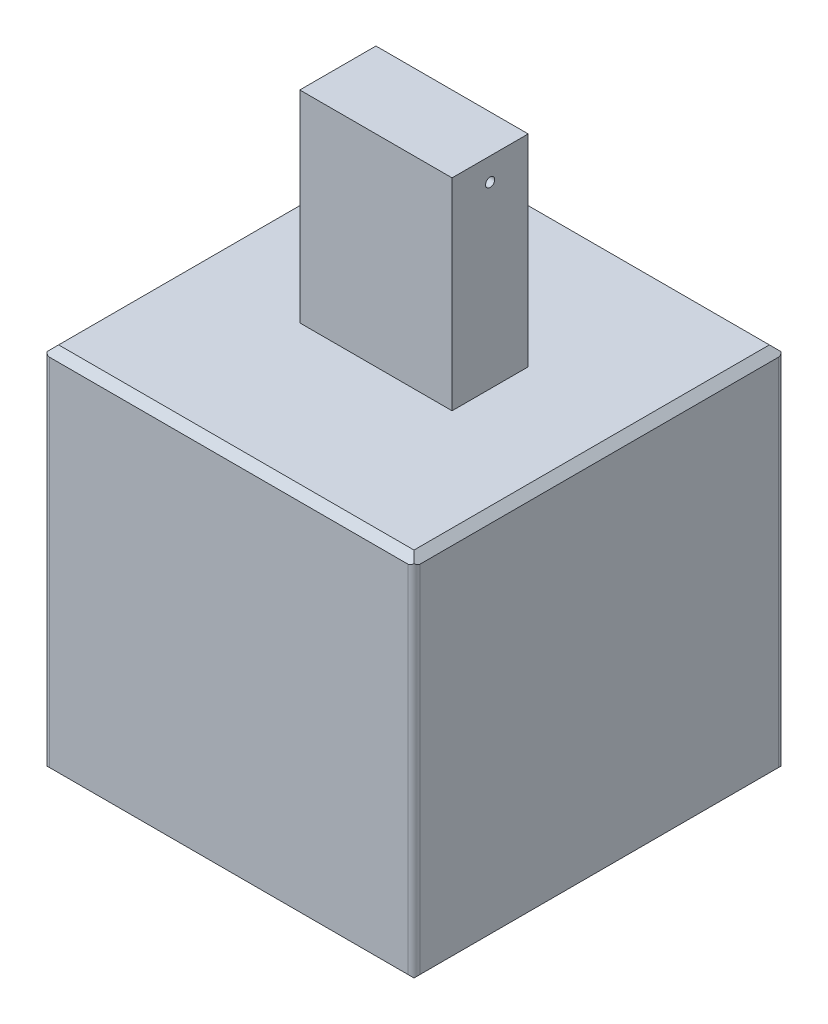
ISO-10303-21;
HEADER;
FILE_DESCRIPTION(('STEP AP214'),'2;1');
FILE_NAME('part.step','',(''),(''),'','','');
FILE_SCHEMA(('AUTOMOTIVE_DESIGN { 1 0 10303 214 1 1 1 1 }'));
ENDSEC;
DATA;
#1=APPLICATION_CONTEXT('core data for automotive mechanical design processes');
#2=APPLICATION_PROTOCOL_DEFINITION('international standard','automotive_design',2000,#1);
#3=PRODUCT_CONTEXT('',#1,'mechanical');
#4=PRODUCT('Part','Part','',(#3));
#5=PRODUCT_RELATED_PRODUCT_CATEGORY('part','',(#4));
#6=PRODUCT_DEFINITION_FORMATION('','',#4);
#7=PRODUCT_DEFINITION_CONTEXT('part definition',#1,'design');
#8=PRODUCT_DEFINITION('design','',#6,#7);
#9=PRODUCT_DEFINITION_SHAPE('','',#8);
#10=(LENGTH_UNIT() NAMED_UNIT(*) SI_UNIT(.MILLI.,.METRE.));
#11=(NAMED_UNIT(*) PLANE_ANGLE_UNIT() SI_UNIT($,.RADIAN.));
#12=(NAMED_UNIT(*) SI_UNIT($,.STERADIAN.) SOLID_ANGLE_UNIT());
#13=UNCERTAINTY_MEASURE_WITH_UNIT(LENGTH_MEASURE(1.E-05),#10,'distance_accuracy_value','');
#14=(GEOMETRIC_REPRESENTATION_CONTEXT(3) GLOBAL_UNCERTAINTY_ASSIGNED_CONTEXT((#13)) GLOBAL_UNIT_ASSIGNED_CONTEXT((#10,
#11,#12)) REPRESENTATION_CONTEXT('',''));
#15=CARTESIAN_POINT('',(0.,0.,0.));
#16=DIRECTION('',(0.,0.,1.));
#17=DIRECTION('',(1.,0.,0.));
#18=AXIS2_PLACEMENT_3D('',#15,#16,#17);
#19=CARTESIAN_POINT('',(0.,486.835,0.));
#20=DIRECTION('',(0.,1.,0.));
#21=DIRECTION('',(0.,0.,1.));
#22=AXIS2_PLACEMENT_3D('',#19,#20,#21);
#23=PLANE('',#22);
#24=DIRECTION('',(0.,0.,1.));
#25=VECTOR('',#24,1.);
#26=CARTESIAN_POINT('',(-87.5,486.835,37.5));
#27=LINE('',#26,#25);
#28=CARTESIAN_POINT('',(-87.5,486.835,-37.5));
#29=VERTEX_POINT('',#28);
#30=CARTESIAN_POINT('',(-87.5,486.835,37.5));
#31=VERTEX_POINT('',#30);
#32=EDGE_CURVE('E59',#29,#31,#27,.T.);
#33=ORIENTED_EDGE('',*,*,#32,.T.);
#34=DIRECTION('',(1.,0.,0.));
#35=VECTOR('',#34,1.);
#36=CARTESIAN_POINT('',(87.5,486.835,37.5));
#37=LINE('',#36,#35);
#38=CARTESIAN_POINT('',(87.5,486.835,37.5));
#39=VERTEX_POINT('',#38);
#40=EDGE_CURVE('E245',#31,#39,#37,.T.);
#41=ORIENTED_EDGE('',*,*,#40,.T.);
#42=DIRECTION('',(0.,0.,-1.));
#43=VECTOR('',#42,1.);
#44=CARTESIAN_POINT('',(87.5,486.835,37.5));
#45=LINE('',#44,#43);
#46=CARTESIAN_POINT('',(87.5,486.835,-37.5));
#47=VERTEX_POINT('',#46);
#48=EDGE_CURVE('E247',#39,#47,#45,.T.);
#49=ORIENTED_EDGE('',*,*,#48,.T.);
#50=DIRECTION('',(-1.,0.,0.));
#51=VECTOR('',#50,1.);
#52=CARTESIAN_POINT('',(87.5,486.835,-37.5));
#53=LINE('',#52,#51);
#54=EDGE_CURVE('E234',#47,#29,#53,.T.);
#55=ORIENTED_EDGE('',*,*,#54,.T.);
#56=EDGE_LOOP('',(#33,#41,#49,#55));
#57=FACE_BOUND('',#56,.T.);
#58=ADVANCED_FACE('F35',(#57),#23,.T.);
#59=CARTESIAN_POINT('',(87.5,736.835,-37.5));
#60=DIRECTION('',(0.,0.,1.));
#61=DIRECTION('',(1.,0.,0.));
#62=AXIS2_PLACEMENT_3D('',#59,#60,#61);
#63=PLANE('',#62);
#64=ORIENTED_EDGE('',*,*,#54,.F.);
#65=DIRECTION('',(0.,-1.,0.));
#66=VECTOR('',#65,1.);
#67=CARTESIAN_POINT('',(87.5,736.835,-37.5));
#68=LINE('',#67,#66);
#69=CARTESIAN_POINT('',(87.5,736.835,-37.5));
#70=VERTEX_POINT('',#69);
#71=EDGE_CURVE('E252',#70,#47,#68,.T.);
#72=ORIENTED_EDGE('',*,*,#71,.F.);
#73=DIRECTION('',(-1.,0.,0.));
#74=VECTOR('',#73,1.);
#75=CARTESIAN_POINT('',(87.5,736.835,-37.5));
#76=LINE('',#75,#74);
#77=CARTESIAN_POINT('',(-87.5,736.835,-37.5));
#78=VERTEX_POINT('',#77);
#79=EDGE_CURVE('E240',#70,#78,#76,.T.);
#80=ORIENTED_EDGE('',*,*,#79,.T.);
#81=DIRECTION('',(0.,-1.,0.));
#82=VECTOR('',#81,1.);
#83=CARTESIAN_POINT('',(-87.5,736.835,-37.5));
#84=LINE('',#83,#82);
#85=EDGE_CURVE('E243',#78,#29,#84,.T.);
#86=ORIENTED_EDGE('',*,*,#85,.T.);
#87=EDGE_LOOP('',(#64,#72,#80,#86));
#88=FACE_BOUND('',#87,.T.);
#89=ADVANCED_FACE('F471',(#88),#63,.T.);
#90=CARTESIAN_POINT('',(87.5,736.835,37.5));
#91=DIRECTION('',(-1.,0.,0.));
#92=DIRECTION('',(0.,0.,1.));
#93=AXIS2_PLACEMENT_3D('',#90,#91,#92);
#94=PLANE('',#93);
#95=CARTESIAN_POINT('',(87.5,721.835,0.));
#96=DIRECTION('',(-1.,0.,0.));
#97=DIRECTION('',(0.,0.,1.));
#98=AXIS2_PLACEMENT_3D('',#95,#96,#97);
#99=CIRCLE('',#98,6.);
#100=CARTESIAN_POINT('',(87.5,721.835,6.));
#101=VERTEX_POINT('',#100);
#102=EDGE_CURVE('E224',#101,#101,#99,.T.);
#103=ORIENTED_EDGE('',*,*,#102,.F.);
#104=EDGE_LOOP('',(#103));
#105=FACE_BOUND('',#104,.T.);
#106=ORIENTED_EDGE('',*,*,#48,.F.);
#107=DIRECTION('',(0.,-1.,0.));
#108=VECTOR('',#107,1.);
#109=CARTESIAN_POINT('',(87.5,736.835,37.5));
#110=LINE('',#109,#108);
#111=CARTESIAN_POINT('',(87.5,736.835,37.5));
#112=VERTEX_POINT('',#111);
#113=EDGE_CURVE('E255',#112,#39,#110,.T.);
#114=ORIENTED_EDGE('',*,*,#113,.F.);
#115=DIRECTION('',(0.,0.,-1.));
#116=VECTOR('',#115,1.);
#117=CARTESIAN_POINT('',(87.5,736.835,37.5));
#118=LINE('',#117,#116);
#119=EDGE_CURVE('E237',#112,#70,#118,.T.);
#120=ORIENTED_EDGE('',*,*,#119,.T.);
#121=ORIENTED_EDGE('',*,*,#71,.T.);
#122=EDGE_LOOP('',(#106,#114,#120,#121));
#123=FACE_BOUND('',#122,.T.);
#124=ADVANCED_FACE('F476',(#105,#123),#94,.T.);
#125=CARTESIAN_POINT('',(87.5,736.835,37.5));
#126=DIRECTION('',(0.,0.,-1.));
#127=DIRECTION('',(-1.,0.,0.));
#128=AXIS2_PLACEMENT_3D('',#125,#126,#127);
#129=PLANE('',#128);
#130=ORIENTED_EDGE('',*,*,#40,.F.);
#131=DIRECTION('',(0.,-1.,0.));
#132=VECTOR('',#131,1.);
#133=CARTESIAN_POINT('',(-87.5,736.835,37.5));
#134=LINE('',#133,#132);
#135=CARTESIAN_POINT('',(-87.5,736.835,37.5));
#136=VERTEX_POINT('',#135);
#137=EDGE_CURVE('E258',#136,#31,#134,.T.);
#138=ORIENTED_EDGE('',*,*,#137,.F.);
#139=DIRECTION('',(1.,0.,0.));
#140=VECTOR('',#139,1.);
#141=CARTESIAN_POINT('',(87.5,736.835,37.5));
#142=LINE('',#141,#140);
#143=EDGE_CURVE('E233',#136,#112,#142,.T.);
#144=ORIENTED_EDGE('',*,*,#143,.T.);
#145=ORIENTED_EDGE('',*,*,#113,.T.);
#146=EDGE_LOOP('',(#130,#138,#144,#145));
#147=FACE_BOUND('',#146,.T.);
#148=ADVANCED_FACE('F528',(#147),#129,.T.);
#149=CARTESIAN_POINT('',(-87.5,736.835,37.5));
#150=DIRECTION('',(1.,0.,0.));
#151=DIRECTION('',(0.,0.,-1.));
#152=AXIS2_PLACEMENT_3D('',#149,#150,#151);
#153=PLANE('',#152);
#154=CARTESIAN_POINT('',(-87.5,721.835,0.));
#155=DIRECTION('',(1.,0.,0.));
#156=DIRECTION('',(0.,0.,-1.));
#157=AXIS2_PLACEMENT_3D('',#154,#155,#156);
#158=CIRCLE('',#157,6.);
#159=CARTESIAN_POINT('',(-87.5,721.835,-6.));
#160=VERTEX_POINT('',#159);
#161=EDGE_CURVE('E39',#160,#160,#158,.T.);
#162=ORIENTED_EDGE('',*,*,#161,.F.);
#163=EDGE_LOOP('',(#162));
#164=FACE_BOUND('',#163,.T.);
#165=ORIENTED_EDGE('',*,*,#32,.F.);
#166=ORIENTED_EDGE('',*,*,#85,.F.);
#167=DIRECTION('',(0.,0.,1.));
#168=VECTOR('',#167,1.);
#169=CARTESIAN_POINT('',(-87.5,736.835,37.5));
#170=LINE('',#169,#168);
#171=EDGE_CURVE('E230',#78,#136,#170,.T.);
#172=ORIENTED_EDGE('',*,*,#171,.T.);
#173=ORIENTED_EDGE('',*,*,#137,.T.);
#174=EDGE_LOOP('',(#165,#166,#172,#173));
#175=FACE_BOUND('',#174,.T.);
#176=ADVANCED_FACE('F506',(#164,#175),#153,.T.);
#177=CARTESIAN_POINT('',(0.,736.835,0.));
#178=DIRECTION('',(0.,1.,0.));
#179=DIRECTION('',(0.,0.,1.));
#180=AXIS2_PLACEMENT_3D('',#177,#178,#179);
#181=PLANE('',#180);
#182=ORIENTED_EDGE('',*,*,#171,.F.);
#183=ORIENTED_EDGE('',*,*,#79,.F.);
#184=ORIENTED_EDGE('',*,*,#119,.F.);
#185=ORIENTED_EDGE('',*,*,#143,.F.);
#186=EDGE_LOOP('',(#182,#183,#184,#185));
#187=FACE_BOUND('',#186,.T.);
#188=ADVANCED_FACE('F518',(#187),#181,.F.);
#189=CARTESIAN_POINT('',(-243.4175,721.835,0.));
#190=DIRECTION('',(1.,0.,0.));
#191=DIRECTION('',(0.,0.,-1.));
#192=AXIS2_PLACEMENT_3D('',#189,#190,#191);
#193=CYLINDRICAL_SURFACE('',#192,6.);
#194=ORIENTED_EDGE('',*,*,#161,.T.);
#195=EDGE_LOOP('',(#194));
#196=FACE_BOUND('',#195,.T.);
#197=CARTESIAN_POINT('',(-100.,721.835,0.));
#198=DIRECTION('',(1.,0.,0.));
#199=DIRECTION('',(0.,0.,-1.));
#200=AXIS2_PLACEMENT_3D('',#197,#198,#199);
#201=CIRCLE('',#200,6.);
#202=CARTESIAN_POINT('',(-100.,721.835,-6.));
#203=VERTEX_POINT('',#202);
#204=EDGE_CURVE('E221',#203,#203,#201,.T.);
#205=ORIENTED_EDGE('',*,*,#204,.F.);
#206=EDGE_LOOP('',(#205));
#207=FACE_BOUND('',#206,.T.);
#208=ADVANCED_FACE('F487',(#196,#207),#193,.F.);
#209=ORIENTED_EDGE('',*,*,#102,.T.);
#210=EDGE_LOOP('',(#209));
#211=FACE_BOUND('',#210,.T.);
#212=CARTESIAN_POINT('',(100.,721.835,0.));
#213=DIRECTION('',(1.,0.,0.));
#214=DIRECTION('',(0.,0.,-1.));
#215=AXIS2_PLACEMENT_3D('',#212,#213,#214);
#216=CIRCLE('',#215,6.);
#217=CARTESIAN_POINT('',(100.,721.835,-6.));
#218=VERTEX_POINT('',#217);
#219=EDGE_CURVE('E547',#218,#218,#216,.T.);
#220=ORIENTED_EDGE('',*,*,#219,.T.);
#221=EDGE_LOOP('',(#220));
#222=FACE_BOUND('',#221,.T.);
#223=ADVANCED_FACE('F481',(#211,#222),#193,.F.);
#224=DIRECTION('',(0.,0.,1.));
#225=VECTOR('',#224,1.);
#226=CARTESIAN_POINT('',(-233.4175,486.835,243.4175));
#227=LINE('',#226,#225);
#228=CARTESIAN_POINT('',(-233.4175,486.835,-233.4175));
#229=VERTEX_POINT('',#228);
#230=CARTESIAN_POINT('',(-233.4175,486.835,233.4175));
#231=VERTEX_POINT('',#230);
#232=EDGE_CURVE('E277',#229,#231,#227,.T.);
#233=ORIENTED_EDGE('',*,*,#232,.T.);
#234=DIRECTION('',(1.,0.,0.));
#235=VECTOR('',#234,1.);
#236=CARTESIAN_POINT('',(243.4175,486.835,233.4175));
#237=LINE('',#236,#235);
#238=CARTESIAN_POINT('',(233.4175,486.835,233.4175));
#239=VERTEX_POINT('',#238);
#240=EDGE_CURVE('E274',#231,#239,#237,.T.);
#241=ORIENTED_EDGE('',*,*,#240,.T.);
#242=DIRECTION('',(0.,0.,-1.));
#243=VECTOR('',#242,1.);
#244=CARTESIAN_POINT('',(233.4175,486.835,-243.4175));
#245=LINE('',#244,#243);
#246=CARTESIAN_POINT('',(233.4175,486.835,-233.4175));
#247=VERTEX_POINT('',#246);
#248=EDGE_CURVE('E272',#239,#247,#245,.T.);
#249=ORIENTED_EDGE('',*,*,#248,.T.);
#250=DIRECTION('',(-1.,0.,0.));
#251=VECTOR('',#250,1.);
#252=CARTESIAN_POINT('',(-243.4175,486.835,-233.4175));
#253=LINE('',#252,#251);
#254=EDGE_CURVE('E279',#247,#229,#253,.T.);
#255=ORIENTED_EDGE('',*,*,#254,.T.);
#256=EDGE_LOOP('',(#233,#241,#249,#255));
#257=FACE_BOUND('',#256,.T.);
#258=DIRECTION('',(1.,0.,0.));
#259=VECTOR('',#258,1.);
#260=CARTESIAN_POINT('',(100.,486.835,50.));
#261=LINE('',#260,#259);
#262=CARTESIAN_POINT('',(-100.,486.835,50.));
#263=VERTEX_POINT('',#262);
#264=CARTESIAN_POINT('',(100.,486.835,50.));
#265=VERTEX_POINT('',#264);
#266=EDGE_CURVE('E262',#263,#265,#261,.T.);
#267=ORIENTED_EDGE('',*,*,#266,.F.);
#268=DIRECTION('',(0.,0.,1.));
#269=VECTOR('',#268,1.);
#270=CARTESIAN_POINT('',(-100.,486.835,50.));
#271=LINE('',#270,#269);
#272=CARTESIAN_POINT('',(-100.,486.835,-50.));
#273=VERTEX_POINT('',#272);
#274=EDGE_CURVE('E203',#273,#263,#271,.T.);
#275=ORIENTED_EDGE('',*,*,#274,.F.);
#276=DIRECTION('',(-1.,0.,0.));
#277=VECTOR('',#276,1.);
#278=CARTESIAN_POINT('',(100.,486.835,-50.));
#279=LINE('',#278,#277);
#280=CARTESIAN_POINT('',(100.,486.835,-50.));
#281=VERTEX_POINT('',#280);
#282=EDGE_CURVE('E266',#281,#273,#279,.T.);
#283=ORIENTED_EDGE('',*,*,#282,.F.);
#284=DIRECTION('',(0.,0.,-1.));
#285=VECTOR('',#284,1.);
#286=CARTESIAN_POINT('',(100.,486.835,50.));
#287=LINE('',#286,#285);
#288=EDGE_CURVE('E264',#265,#281,#287,.T.);
#289=ORIENTED_EDGE('',*,*,#288,.F.);
#290=EDGE_LOOP('',(#267,#275,#283,#289));
#291=FACE_BOUND('',#290,.T.);
#292=ADVANCED_FACE('F472',(#257,#291),#23,.T.);
#293=CARTESIAN_POINT('',(-243.4175,486.835,243.4175));
#294=DIRECTION('',(1.,0.,0.));
#295=DIRECTION('',(0.,0.,-1.));
#296=AXIS2_PLACEMENT_3D('',#293,#294,#295);
#297=PLANE('',#296);
#298=DIRECTION('',(0.,0.,-1.));
#299=VECTOR('',#298,1.);
#300=CARTESIAN_POINT('',(-243.4175,476.835,-243.4175));
#301=LINE('',#300,#299);
#302=CARTESIAN_POINT('',(-243.4175,476.835,235.4175));
#303=VERTEX_POINT('',#302);
#304=CARTESIAN_POINT('',(-243.4175,476.835,-235.4175));
#305=VERTEX_POINT('',#304);
#306=EDGE_CURVE('E285',#303,#305,#301,.T.);
#307=ORIENTED_EDGE('',*,*,#306,.T.);
#308=DIRECTION('',(0.,-1.,0.));
#309=VECTOR('',#308,1.);
#310=CARTESIAN_POINT('',(-243.4175,486.835,-235.4175));
#311=LINE('',#310,#309);
#312=CARTESIAN_POINT('',(-243.4175,10.,-235.4175));
#313=VERTEX_POINT('',#312);
#314=EDGE_CURVE('E376',#305,#313,#311,.T.);
#315=ORIENTED_EDGE('',*,*,#314,.T.);
#316=DIRECTION('',(0.,0.,1.));
#317=VECTOR('',#316,1.);
#318=CARTESIAN_POINT('',(-243.4175,10.,243.4175));
#319=LINE('',#318,#317);
#320=CARTESIAN_POINT('',(-243.4175,10.,235.4175));
#321=VERTEX_POINT('',#320);
#322=EDGE_CURVE('E321',#313,#321,#319,.T.);
#323=ORIENTED_EDGE('',*,*,#322,.T.);
#324=DIRECTION('',(0.,-1.,0.));
#325=VECTOR('',#324,1.);
#326=CARTESIAN_POINT('',(-243.4175,486.835,235.4175));
#327=LINE('',#326,#325);
#328=EDGE_CURVE('E374',#321,#303,#327,.F.);
#329=ORIENTED_EDGE('',*,*,#328,.T.);
#330=EDGE_LOOP('',(#307,#315,#323,#329));
#331=FACE_BOUND('',#330,.T.);
#332=ADVANCED_FACE('F454',(#331),#297,.F.);
#333=CARTESIAN_POINT('',(243.4175,486.835,243.4175));
#334=DIRECTION('',(0.,0.,-1.));
#335=DIRECTION('',(-1.,0.,0.));
#336=AXIS2_PLACEMENT_3D('',#333,#334,#335);
#337=PLANE('',#336);
#338=DIRECTION('',(1.,0.,0.));
#339=VECTOR('',#338,1.);
#340=CARTESIAN_POINT('',(243.4175,10.,243.4175));
#341=LINE('',#340,#339);
#342=CARTESIAN_POINT('',(-235.4175,10.,243.4175));
#343=VERTEX_POINT('',#342);
#344=CARTESIAN_POINT('',(235.4175,10.,243.4175));
#345=VERTEX_POINT('',#344);
#346=EDGE_CURVE('E324',#343,#345,#341,.T.);
#347=ORIENTED_EDGE('',*,*,#346,.T.);
#348=DIRECTION('',(0.,-1.,0.));
#349=VECTOR('',#348,1.);
#350=CARTESIAN_POINT('',(235.4175,486.835,243.4175));
#351=LINE('',#350,#349);
#352=CARTESIAN_POINT('',(235.4175,476.835,243.4175));
#353=VERTEX_POINT('',#352);
#354=EDGE_CURVE('E368',#345,#353,#351,.F.);
#355=ORIENTED_EDGE('',*,*,#354,.T.);
#356=DIRECTION('',(-1.,0.,0.));
#357=VECTOR('',#356,1.);
#358=CARTESIAN_POINT('',(-243.4175,476.835,243.4175));
#359=LINE('',#358,#357);
#360=CARTESIAN_POINT('',(-235.4175,476.835,243.4175));
#361=VERTEX_POINT('',#360);
#362=EDGE_CURVE('E288',#353,#361,#359,.T.);
#363=ORIENTED_EDGE('',*,*,#362,.T.);
#364=DIRECTION('',(0.,-1.,0.));
#365=VECTOR('',#364,1.);
#366=CARTESIAN_POINT('',(-235.4175,486.835,243.4175));
#367=LINE('',#366,#365);
#368=EDGE_CURVE('E365',#361,#343,#367,.T.);
#369=ORIENTED_EDGE('',*,*,#368,.T.);
#370=EDGE_LOOP('',(#347,#355,#363,#369));
#371=FACE_BOUND('',#370,.T.);
#372=ADVANCED_FACE('F402',(#371),#337,.F.);
#373=CARTESIAN_POINT('',(243.4175,486.835,243.4175));
#374=DIRECTION('',(-1.,0.,0.));
#375=DIRECTION('',(0.,0.,1.));
#376=AXIS2_PLACEMENT_3D('',#373,#374,#375);
#377=PLANE('',#376);
#378=DIRECTION('',(0.,0.,-1.));
#379=VECTOR('',#378,1.);
#380=CARTESIAN_POINT('',(243.4175,10.,243.4175));
#381=LINE('',#380,#379);
#382=CARTESIAN_POINT('',(243.4175,10.,235.4175));
#383=VERTEX_POINT('',#382);
#384=CARTESIAN_POINT('',(243.4175,10.,-235.4175));
#385=VERTEX_POINT('',#384);
#386=EDGE_CURVE('E294',#383,#385,#381,.T.);
#387=ORIENTED_EDGE('',*,*,#386,.T.);
#388=DIRECTION('',(0.,-1.,0.));
#389=VECTOR('',#388,1.);
#390=CARTESIAN_POINT('',(243.4175,486.835,-235.4175));
#391=LINE('',#390,#389);
#392=CARTESIAN_POINT('',(243.4175,476.835,-235.4175));
#393=VERTEX_POINT('',#392);
#394=EDGE_CURVE('E351',#385,#393,#391,.F.);
#395=ORIENTED_EDGE('',*,*,#394,.T.);
#396=DIRECTION('',(0.,0.,1.));
#397=VECTOR('',#396,1.);
#398=CARTESIAN_POINT('',(243.4175,476.835,243.4175));
#399=LINE('',#398,#397);
#400=CARTESIAN_POINT('',(243.4175,476.835,235.4175));
#401=VERTEX_POINT('',#400);
#402=EDGE_CURVE('E291',#393,#401,#399,.T.);
#403=ORIENTED_EDGE('',*,*,#402,.T.);
#404=DIRECTION('',(0.,-1.,0.));
#405=VECTOR('',#404,1.);
#406=CARTESIAN_POINT('',(243.4175,486.835,235.4175));
#407=LINE('',#406,#405);
#408=EDGE_CURVE('E348',#401,#383,#407,.T.);
#409=ORIENTED_EDGE('',*,*,#408,.T.);
#410=EDGE_LOOP('',(#387,#395,#403,#409));
#411=FACE_BOUND('',#410,.T.);
#412=ADVANCED_FACE('F422',(#411),#377,.F.);
#413=CARTESIAN_POINT('',(243.4175,486.835,-243.4175));
#414=DIRECTION('',(0.,0.,1.));
#415=DIRECTION('',(1.,0.,0.));
#416=AXIS2_PLACEMENT_3D('',#413,#414,#415);
#417=PLANE('',#416);
#418=DIRECTION('',(1.,0.,0.));
#419=VECTOR('',#418,1.);
#420=CARTESIAN_POINT('',(243.4175,476.835,-243.4175));
#421=LINE('',#420,#419);
#422=CARTESIAN_POINT('',(-235.4175,476.835,-243.4175));
#423=VERTEX_POINT('',#422);
#424=CARTESIAN_POINT('',(235.4175,476.835,-243.4175));
#425=VERTEX_POINT('',#424);
#426=EDGE_CURVE('E282',#423,#425,#421,.T.);
#427=ORIENTED_EDGE('',*,*,#426,.T.);
#428=DIRECTION('',(0.,-1.,0.));
#429=VECTOR('',#428,1.);
#430=CARTESIAN_POINT('',(235.4175,486.835,-243.4175));
#431=LINE('',#430,#429);
#432=CARTESIAN_POINT('',(235.4175,10.,-243.4175));
#433=VERTEX_POINT('',#432);
#434=EDGE_CURVE('E337',#425,#433,#431,.T.);
#435=ORIENTED_EDGE('',*,*,#434,.T.);
#436=DIRECTION('',(-1.,0.,0.));
#437=VECTOR('',#436,1.);
#438=CARTESIAN_POINT('',(243.4175,10.,-243.4175));
#439=LINE('',#438,#437);
#440=CARTESIAN_POINT('',(-235.4175,10.,-243.4175));
#441=VERTEX_POINT('',#440);
#442=EDGE_CURVE('E318',#433,#441,#439,.T.);
#443=ORIENTED_EDGE('',*,*,#442,.T.);
#444=DIRECTION('',(0.,-1.,0.));
#445=VECTOR('',#444,1.);
#446=CARTESIAN_POINT('',(-235.4175,486.835,-243.4175));
#447=LINE('',#446,#445);
#448=EDGE_CURVE('E327',#441,#423,#447,.F.);
#449=ORIENTED_EDGE('',*,*,#448,.T.);
#450=EDGE_LOOP('',(#427,#435,#443,#449));
#451=FACE_BOUND('',#450,.T.);
#452=ADVANCED_FACE('F440',(#451),#417,.F.);
#453=CARTESIAN_POINT('',(0.,0.,0.));
#454=DIRECTION('',(0.,1.,0.));
#455=DIRECTION('',(0.,0.,1.));
#456=AXIS2_PLACEMENT_3D('',#453,#454,#455);
#457=PLANE('',#456);
#458=DIRECTION('',(1.,0.,0.));
#459=VECTOR('',#458,1.);
#460=CARTESIAN_POINT('',(0.,0.,-233.4175));
#461=LINE('',#460,#459);
#462=CARTESIAN_POINT('',(-233.4175,0.,-233.4175));
#463=VERTEX_POINT('',#462);
#464=CARTESIAN_POINT('',(233.4175,0.,-233.4175));
#465=VERTEX_POINT('',#464);
#466=EDGE_CURVE('E313',#463,#465,#461,.T.);
#467=ORIENTED_EDGE('',*,*,#466,.T.);
#468=DIRECTION('',(0.,0.,1.));
#469=VECTOR('',#468,1.);
#470=CARTESIAN_POINT('',(233.4175,0.,0.));
#471=LINE('',#470,#469);
#472=CARTESIAN_POINT('',(233.4175,0.,233.4175));
#473=VERTEX_POINT('',#472);
#474=EDGE_CURVE('E315',#465,#473,#471,.T.);
#475=ORIENTED_EDGE('',*,*,#474,.T.);
#476=DIRECTION('',(-1.,0.,0.));
#477=VECTOR('',#476,1.);
#478=CARTESIAN_POINT('',(0.,0.,233.4175));
#479=LINE('',#478,#477);
#480=CARTESIAN_POINT('',(-233.4175,0.,233.4175));
#481=VERTEX_POINT('',#480);
#482=EDGE_CURVE('E308',#473,#481,#479,.T.);
#483=ORIENTED_EDGE('',*,*,#482,.T.);
#484=DIRECTION('',(0.,0.,-1.));
#485=VECTOR('',#484,1.);
#486=CARTESIAN_POINT('',(-233.4175,0.,0.));
#487=LINE('',#486,#485);
#488=EDGE_CURVE('E311',#481,#463,#487,.T.);
#489=ORIENTED_EDGE('',*,*,#488,.T.);
#490=EDGE_LOOP('',(#467,#475,#483,#489));
#491=FACE_BOUND('',#490,.T.);
#492=ADVANCED_FACE('F459',(#491),#457,.F.);
#493=CARTESIAN_POINT('',(0.,486.835,233.4175));
#494=DIRECTION('',(0.,0.707106781186547,0.707106781186547));
#495=DIRECTION('',(-1.,0.,0.));
#496=AXIS2_PLACEMENT_3D('',#493,#494,#495);
#497=PLANE('',#496);
#498=ORIENTED_EDGE('',*,*,#362,.F.);
#499=CARTESIAN_POINT('',(235.4175,484.835,235.4175));
#500=DIRECTION('',(0.,0.707106781186547,0.707106781186547));
#501=DIRECTION('',(0.,-0.707106781186548,0.707106781186548));
#502=AXIS2_PLACEMENT_3D('',#499,#500,#501);
#503=ELLIPSE('',#502,11.3137084989848,8.);
#504=CARTESIAN_POINT('',(241.074354249492,479.178145750508,241.074354249492));
#505=VERTEX_POINT('',#504);
#506=EDGE_CURVE('E372',#353,#505,#503,.T.);
#507=ORIENTED_EDGE('',*,*,#506,.T.);
#508=DIRECTION('',(0.577350269189626,-0.577350269189626,0.577350269189626));
#509=VECTOR('',#508,1.);
#510=CARTESIAN_POINT('',(155.611666666667,564.640833333333,155.611666666667));
#511=LINE('',#510,#509);
#512=EDGE_CURVE('E275',#239,#505,#511,.T.);
#513=ORIENTED_EDGE('',*,*,#512,.F.);
#514=ORIENTED_EDGE('',*,*,#240,.F.);
#515=DIRECTION('',(-0.577350269189626,-0.577350269189626,0.577350269189626));
#516=VECTOR('',#515,1.);
#517=CARTESIAN_POINT('',(-155.611666666667,564.640833333333,155.611666666667));
#518=LINE('',#517,#516);
#519=CARTESIAN_POINT('',(-241.074354249492,479.178145750507,241.074354249492));
#520=VERTEX_POINT('',#519);
#521=EDGE_CURVE('E301',#520,#231,#518,.F.);
#522=ORIENTED_EDGE('',*,*,#521,.F.);
#523=CARTESIAN_POINT('',(-235.4175,484.835,235.4175));
#524=DIRECTION('',(0.,0.707106781186547,0.707106781186547));
#525=DIRECTION('',(0.,-0.707106781186548,0.707106781186548));
#526=AXIS2_PLACEMENT_3D('',#523,#524,#525);
#527=ELLIPSE('',#526,11.3137084989848,8.);
#528=EDGE_CURVE('E370',#520,#361,#527,.T.);
#529=ORIENTED_EDGE('',*,*,#528,.T.);
#530=EDGE_LOOP('',(#498,#507,#513,#514,#522,#529));
#531=FACE_BOUND('',#530,.T.);
#532=ADVANCED_FACE('F396',(#531),#497,.T.);
#533=CARTESIAN_POINT('',(233.4175,486.835,0.));
#534=DIRECTION('',(0.707106781186547,0.707106781186547,0.));
#535=DIRECTION('',(0.,0.,1.));
#536=AXIS2_PLACEMENT_3D('',#533,#534,#535);
#537=PLANE('',#536);
#538=ORIENTED_EDGE('',*,*,#402,.F.);
#539=CARTESIAN_POINT('',(235.4175,484.835,-235.4175));
#540=DIRECTION('',(0.707106781186547,0.707106781186547,0.));
#541=DIRECTION('',(0.707106781186548,-0.707106781186548,0.));
#542=AXIS2_PLACEMENT_3D('',#539,#540,#541);
#543=ELLIPSE('',#542,11.3137084989848,8.);
#544=CARTESIAN_POINT('',(241.074354249492,479.178145750507,-241.074354249492));
#545=VERTEX_POINT('',#544);
#546=EDGE_CURVE('E355',#393,#545,#543,.T.);
#547=ORIENTED_EDGE('',*,*,#546,.T.);
#548=DIRECTION('',(-0.577350269189626,0.577350269189626,0.577350269189626));
#549=VECTOR('',#548,1.);
#550=CARTESIAN_POINT('',(155.611666666667,564.640833333333,-155.611666666667));
#551=LINE('',#550,#549);
#552=EDGE_CURVE('E297',#247,#545,#551,.F.);
#553=ORIENTED_EDGE('',*,*,#552,.F.);
#554=ORIENTED_EDGE('',*,*,#248,.F.);
#555=ORIENTED_EDGE('',*,*,#512,.T.);
#556=CARTESIAN_POINT('',(235.4175,484.835,235.4175));
#557=DIRECTION('',(0.707106781186547,0.707106781186547,0.));
#558=DIRECTION('',(0.707106781186548,-0.707106781186548,0.));
#559=AXIS2_PLACEMENT_3D('',#556,#557,#558);
#560=ELLIPSE('',#559,11.3137084989848,8.);
#561=EDGE_CURVE('E353',#505,#401,#560,.T.);
#562=ORIENTED_EDGE('',*,*,#561,.T.);
#563=EDGE_LOOP('',(#538,#547,#553,#554,#555,#562));
#564=FACE_BOUND('',#563,.T.);
#565=ADVANCED_FACE('F418',(#564),#537,.T.);
#566=CARTESIAN_POINT('',(-233.4175,486.835,0.));
#567=DIRECTION('',(-0.707106781186547,0.707106781186547,0.));
#568=DIRECTION('',(0.,0.,-1.));
#569=AXIS2_PLACEMENT_3D('',#566,#567,#568);
#570=PLANE('',#569);
#571=DIRECTION('',(-0.577350269189626,-0.577350269189626,-0.577350269189626));
#572=VECTOR('',#571,1.);
#573=CARTESIAN_POINT('',(-155.611666666667,564.640833333333,-155.611666666667));
#574=LINE('',#573,#572);
#575=CARTESIAN_POINT('',(-241.074354249492,479.178145750508,-241.074354249492));
#576=VERTEX_POINT('',#575);
#577=EDGE_CURVE('E295',#576,#229,#574,.F.);
#578=ORIENTED_EDGE('',*,*,#577,.F.);
#579=CARTESIAN_POINT('',(-235.4175,484.835,-235.4175));
#580=DIRECTION('',(-0.707106781186547,0.707106781186547,0.));
#581=DIRECTION('',(-0.707106781186548,-0.707106781186548,0.));
#582=AXIS2_PLACEMENT_3D('',#579,#580,#581);
#583=ELLIPSE('',#582,11.3137084989848,8.);
#584=EDGE_CURVE('E11',#576,#305,#583,.T.);
#585=ORIENTED_EDGE('',*,*,#584,.T.);
#586=ORIENTED_EDGE('',*,*,#306,.F.);
#587=CARTESIAN_POINT('',(-235.4175,484.835,235.4175));
#588=DIRECTION('',(-0.707106781186547,0.707106781186547,0.));
#589=DIRECTION('',(-0.707106781186548,-0.707106781186548,0.));
#590=AXIS2_PLACEMENT_3D('',#587,#588,#589);
#591=ELLIPSE('',#590,11.3137084989848,8.);
#592=EDGE_CURVE('E44',#303,#520,#591,.T.);
#593=ORIENTED_EDGE('',*,*,#592,.T.);
#594=ORIENTED_EDGE('',*,*,#521,.T.);
#595=ORIENTED_EDGE('',*,*,#232,.F.);
#596=EDGE_LOOP('',(#578,#585,#586,#593,#594,#595));
#597=FACE_BOUND('',#596,.T.);
#598=ADVANCED_FACE('F388',(#597),#570,.T.);
#599=CARTESIAN_POINT('',(0.,486.835,-233.4175));
#600=DIRECTION('',(0.,0.707106781186547,-0.707106781186547));
#601=DIRECTION('',(1.,0.,0.));
#602=AXIS2_PLACEMENT_3D('',#599,#600,#601);
#603=PLANE('',#602);
#604=ORIENTED_EDGE('',*,*,#552,.T.);
#605=CARTESIAN_POINT('',(235.4175,484.835,-235.4175));
#606=DIRECTION('',(0.,0.707106781186547,-0.707106781186547));
#607=DIRECTION('',(0.,-0.707106781186548,-0.707106781186548));
#608=AXIS2_PLACEMENT_3D('',#605,#606,#607);
#609=ELLIPSE('',#608,11.3137084989848,8.);
#610=EDGE_CURVE('E359',#545,#425,#609,.T.);
#611=ORIENTED_EDGE('',*,*,#610,.T.);
#612=ORIENTED_EDGE('',*,*,#426,.F.);
#613=CARTESIAN_POINT('',(-235.4175,484.835,-235.4175));
#614=DIRECTION('',(0.,0.707106781186547,-0.707106781186547));
#615=DIRECTION('',(0.,-0.707106781186548,-0.707106781186548));
#616=AXIS2_PLACEMENT_3D('',#613,#614,#615);
#617=ELLIPSE('',#616,11.3137084989848,8.);
#618=EDGE_CURVE('E357',#423,#576,#617,.T.);
#619=ORIENTED_EDGE('',*,*,#618,.T.);
#620=ORIENTED_EDGE('',*,*,#577,.T.);
#621=ORIENTED_EDGE('',*,*,#254,.F.);
#622=EDGE_LOOP('',(#604,#611,#612,#619,#620,#621));
#623=FACE_BOUND('',#622,.T.);
#624=ADVANCED_FACE('F436',(#623),#603,.T.);
#625=CARTESIAN_POINT('',(-243.4175,10.,243.4175));
#626=DIRECTION('',(0.707106781186543,0.707106781186551,0.));
#627=DIRECTION('',(0.,0.,1.));
#628=AXIS2_PLACEMENT_3D('',#625,#626,#627);
#629=PLANE('',#628);
#630=ORIENTED_EDGE('',*,*,#322,.F.);
#631=CARTESIAN_POINT('',(-235.4175,2.00000000000006,-235.4175));
#632=DIRECTION('',(0.707106781186543,0.707106781186551,0.));
#633=DIRECTION('',(0.707106781186551,-0.707106781186544,0.));
#634=AXIS2_PLACEMENT_3D('',#631,#632,#633);
#635=ELLIPSE('',#634,11.3137084989847,8.);
#636=CARTESIAN_POINT('',(-241.074354249492,7.65685424949245,-241.074354249492));
#637=VERTEX_POINT('',#636);
#638=EDGE_CURVE('E381',#313,#637,#635,.F.);
#639=ORIENTED_EDGE('',*,*,#638,.T.);
#640=DIRECTION('',(0.577350269189628,-0.577350269189622,0.577350269189628));
#641=VECTOR('',#640,1.);
#642=CARTESIAN_POINT('',(-81.1391666666654,-152.278333333333,-81.1391666666654));
#643=LINE('',#642,#641);
#644=EDGE_CURVE('E332',#463,#637,#643,.F.);
#645=ORIENTED_EDGE('',*,*,#644,.F.);
#646=ORIENTED_EDGE('',*,*,#488,.F.);
#647=DIRECTION('',(0.577350269189628,-0.577350269189622,-0.577350269189628));
#648=VECTOR('',#647,1.);
#649=CARTESIAN_POINT('',(-81.1391666666654,-152.278333333333,81.1391666666655));
#650=LINE('',#649,#648);
#651=CARTESIAN_POINT('',(-241.074354249492,7.65685424949245,241.074354249492));
#652=VERTEX_POINT('',#651);
#653=EDGE_CURVE('E298',#652,#481,#650,.T.);
#654=ORIENTED_EDGE('',*,*,#653,.F.);
#655=CARTESIAN_POINT('',(-235.4175,2.00000000000006,235.4175));
#656=DIRECTION('',(0.707106781186543,0.707106781186551,0.));
#657=DIRECTION('',(0.707106781186551,-0.707106781186544,0.));
#658=AXIS2_PLACEMENT_3D('',#655,#656,#657);
#659=ELLIPSE('',#658,11.3137084989847,8.);
#660=EDGE_CURVE('E379',#652,#321,#659,.F.);
#661=ORIENTED_EDGE('',*,*,#660,.T.);
#662=EDGE_LOOP('',(#630,#639,#645,#646,#654,#661));
#663=FACE_BOUND('',#662,.T.);
#664=ADVANCED_FACE('F456',(#663),#629,.F.);
#665=CARTESIAN_POINT('',(243.4175,10.,243.4175));
#666=DIRECTION('',(0.,0.707106781186551,-0.707106781186543));
#667=DIRECTION('',(1.,0.,0.));
#668=AXIS2_PLACEMENT_3D('',#665,#666,#667);
#669=PLANE('',#668);
#670=DIRECTION('',(0.577350269189628,0.577350269189622,0.577350269189628));
#671=VECTOR('',#670,1.);
#672=CARTESIAN_POINT('',(243.4175,10.,243.4175));
#673=LINE('',#672,#671);
#674=CARTESIAN_POINT('',(241.074354249492,7.65685424949244,241.074354249492));
#675=VERTEX_POINT('',#674);
#676=EDGE_CURVE('E330',#675,#473,#673,.F.);
#677=ORIENTED_EDGE('',*,*,#676,.F.);
#678=CARTESIAN_POINT('',(235.4175,2.00000000000006,235.4175));
#679=DIRECTION('',(0.,0.707106781186551,-0.707106781186543));
#680=DIRECTION('',(0.,-0.707106781186544,-0.707106781186551));
#681=AXIS2_PLACEMENT_3D('',#678,#679,#680);
#682=ELLIPSE('',#681,11.3137084989847,8.);
#683=EDGE_CURVE('E363',#675,#345,#682,.F.);
#684=ORIENTED_EDGE('',*,*,#683,.T.);
#685=ORIENTED_EDGE('',*,*,#346,.F.);
#686=CARTESIAN_POINT('',(-235.4175,2.00000000000017,235.4175));
#687=DIRECTION('',(0.,0.707106781186551,-0.707106781186543));
#688=DIRECTION('',(0.,-0.707106781186544,-0.707106781186551));
#689=AXIS2_PLACEMENT_3D('',#686,#687,#688);
#690=ELLIPSE('',#689,11.3137084989847,8.);
#691=EDGE_CURVE('E361',#343,#652,#690,.F.);
#692=ORIENTED_EDGE('',*,*,#691,.T.);
#693=ORIENTED_EDGE('',*,*,#653,.T.);
#694=ORIENTED_EDGE('',*,*,#482,.F.);
#695=EDGE_LOOP('',(#677,#684,#685,#692,#693,#694));
#696=FACE_BOUND('',#695,.T.);
#697=ADVANCED_FACE('F406',(#696),#669,.F.);
#698=CARTESIAN_POINT('',(243.4175,10.,-243.4175));
#699=DIRECTION('',(0.,0.707106781186551,0.707106781186543));
#700=DIRECTION('',(-1.,0.,0.));
#701=AXIS2_PLACEMENT_3D('',#698,#699,#700);
#702=PLANE('',#701);
#703=ORIENTED_EDGE('',*,*,#442,.F.);
#704=CARTESIAN_POINT('',(235.4175,2.00000000000006,-235.4175));
#705=DIRECTION('',(0.,0.707106781186551,0.707106781186543));
#706=DIRECTION('',(0.,-0.707106781186544,0.707106781186551));
#707=AXIS2_PLACEMENT_3D('',#704,#705,#706);
#708=ELLIPSE('',#707,11.3137084989847,8.);
#709=CARTESIAN_POINT('',(241.074354249492,7.65685424949244,-241.074354249492));
#710=VERTEX_POINT('',#709);
#711=EDGE_CURVE('E342',#433,#710,#708,.F.);
#712=ORIENTED_EDGE('',*,*,#711,.T.);
#713=DIRECTION('',(-0.577350269189628,-0.577350269189622,0.577350269189628));
#714=VECTOR('',#713,1.);
#715=CARTESIAN_POINT('',(243.4175,10.,-243.4175));
#716=LINE('',#715,#714);
#717=EDGE_CURVE('E206',#465,#710,#716,.F.);
#718=ORIENTED_EDGE('',*,*,#717,.F.);
#719=ORIENTED_EDGE('',*,*,#466,.F.);
#720=ORIENTED_EDGE('',*,*,#644,.T.);
#721=CARTESIAN_POINT('',(-235.4175,2.00000000000006,-235.4175));
#722=DIRECTION('',(0.,0.707106781186551,0.707106781186543));
#723=DIRECTION('',(0.,-0.707106781186544,0.707106781186551));
#724=AXIS2_PLACEMENT_3D('',#721,#722,#723);
#725=ELLIPSE('',#724,11.3137084989847,8.);
#726=EDGE_CURVE('E340',#637,#441,#725,.F.);
#727=ORIENTED_EDGE('',*,*,#726,.T.);
#728=EDGE_LOOP('',(#703,#712,#718,#719,#720,#727));
#729=FACE_BOUND('',#728,.T.);
#730=ADVANCED_FACE('F443',(#729),#702,.F.);
#731=CARTESIAN_POINT('',(243.4175,10.,243.4175));
#732=DIRECTION('',(-0.707106781186543,0.707106781186551,0.));
#733=DIRECTION('',(0.,0.,-1.));
#734=AXIS2_PLACEMENT_3D('',#731,#732,#733);
#735=PLANE('',#734);
#736=ORIENTED_EDGE('',*,*,#717,.T.);
#737=CARTESIAN_POINT('',(235.4175,2.00000000000006,-235.4175));
#738=DIRECTION('',(-0.707106781186543,0.707106781186551,0.));
#739=DIRECTION('',(-0.707106781186551,-0.707106781186544,0.));
#740=AXIS2_PLACEMENT_3D('',#737,#738,#739);
#741=ELLIPSE('',#740,11.3137084989847,8.);
#742=EDGE_CURVE('E346',#710,#385,#741,.F.);
#743=ORIENTED_EDGE('',*,*,#742,.T.);
#744=ORIENTED_EDGE('',*,*,#386,.F.);
#745=CARTESIAN_POINT('',(235.4175,2.00000000000006,235.4175));
#746=DIRECTION('',(-0.707106781186543,0.707106781186551,0.));
#747=DIRECTION('',(-0.707106781186551,-0.707106781186544,0.));
#748=AXIS2_PLACEMENT_3D('',#745,#746,#747);
#749=ELLIPSE('',#748,11.3137084989847,8.);
#750=EDGE_CURVE('E344',#383,#675,#749,.F.);
#751=ORIENTED_EDGE('',*,*,#750,.T.);
#752=ORIENTED_EDGE('',*,*,#676,.T.);
#753=ORIENTED_EDGE('',*,*,#474,.F.);
#754=EDGE_LOOP('',(#736,#743,#744,#751,#752,#753));
#755=FACE_BOUND('',#754,.T.);
#756=ADVANCED_FACE('F425',(#755),#735,.F.);
#757=CARTESIAN_POINT('',(235.4175,486.835,-235.4175));
#758=DIRECTION('',(0.,-1.,0.));
#759=DIRECTION('',(0.,0.,-1.));
#760=AXIS2_PLACEMENT_3D('',#757,#758,#759);
#761=CYLINDRICAL_SURFACE('',#760,8.);
#762=ORIENTED_EDGE('',*,*,#546,.F.);
#763=ORIENTED_EDGE('',*,*,#394,.F.);
#764=ORIENTED_EDGE('',*,*,#742,.F.);
#765=ORIENTED_EDGE('',*,*,#711,.F.);
#766=ORIENTED_EDGE('',*,*,#434,.F.);
#767=ORIENTED_EDGE('',*,*,#610,.F.);
#768=EDGE_LOOP('',(#762,#763,#764,#765,#766,#767));
#769=FACE_BOUND('',#768,.T.);
#770=ADVANCED_FACE('F431',(#769),#761,.T.);
#771=CARTESIAN_POINT('',(235.4175,486.835,235.4175));
#772=DIRECTION('',(0.,-1.,0.));
#773=DIRECTION('',(0.,0.,-1.));
#774=AXIS2_PLACEMENT_3D('',#771,#772,#773);
#775=CYLINDRICAL_SURFACE('',#774,8.);
#776=ORIENTED_EDGE('',*,*,#506,.F.);
#777=ORIENTED_EDGE('',*,*,#354,.F.);
#778=ORIENTED_EDGE('',*,*,#683,.F.);
#779=ORIENTED_EDGE('',*,*,#750,.F.);
#780=ORIENTED_EDGE('',*,*,#408,.F.);
#781=ORIENTED_EDGE('',*,*,#561,.F.);
#782=EDGE_LOOP('',(#776,#777,#778,#779,#780,#781));
#783=FACE_BOUND('',#782,.T.);
#784=ADVANCED_FACE('F412',(#783),#775,.T.);
#785=CARTESIAN_POINT('',(-235.4175,486.835,-235.4175));
#786=DIRECTION('',(0.,-1.,0.));
#787=DIRECTION('',(0.,0.,-1.));
#788=AXIS2_PLACEMENT_3D('',#785,#786,#787);
#789=CYLINDRICAL_SURFACE('',#788,8.);
#790=ORIENTED_EDGE('',*,*,#618,.F.);
#791=ORIENTED_EDGE('',*,*,#448,.F.);
#792=ORIENTED_EDGE('',*,*,#726,.F.);
#793=ORIENTED_EDGE('',*,*,#638,.F.);
#794=ORIENTED_EDGE('',*,*,#314,.F.);
#795=ORIENTED_EDGE('',*,*,#584,.F.);
#796=EDGE_LOOP('',(#790,#791,#792,#793,#794,#795));
#797=FACE_BOUND('',#796,.T.);
#798=ADVANCED_FACE('F449',(#797),#789,.T.);
#799=CARTESIAN_POINT('',(-235.4175,486.835,235.4175));
#800=DIRECTION('',(0.,-1.,0.));
#801=DIRECTION('',(0.,0.,-1.));
#802=AXIS2_PLACEMENT_3D('',#799,#800,#801);
#803=CYLINDRICAL_SURFACE('',#802,8.);
#804=ORIENTED_EDGE('',*,*,#592,.F.);
#805=ORIENTED_EDGE('',*,*,#328,.F.);
#806=ORIENTED_EDGE('',*,*,#660,.F.);
#807=ORIENTED_EDGE('',*,*,#691,.F.);
#808=ORIENTED_EDGE('',*,*,#368,.F.);
#809=ORIENTED_EDGE('',*,*,#528,.F.);
#810=EDGE_LOOP('',(#804,#805,#806,#807,#808,#809));
#811=FACE_BOUND('',#810,.T.);
#812=ADVANCED_FACE('F37',(#811),#803,.T.);
#813=CARTESIAN_POINT('',(-100.,736.835,50.));
#814=DIRECTION('',(1.,0.,0.));
#815=DIRECTION('',(0.,0.,-1.));
#816=AXIS2_PLACEMENT_3D('',#813,#814,#815);
#817=PLANE('',#816);
#818=ORIENTED_EDGE('',*,*,#204,.T.);
#819=EDGE_LOOP('',(#818));
#820=FACE_BOUND('',#819,.T.);
#821=ORIENTED_EDGE('',*,*,#274,.T.);
#822=DIRECTION('',(0.,-1.,0.));
#823=VECTOR('',#822,1.);
#824=CARTESIAN_POINT('',(-100.,736.835,50.));
#825=LINE('',#824,#823);
#826=CARTESIAN_POINT('',(-100.,751.835,50.));
#827=VERTEX_POINT('',#826);
#828=EDGE_CURVE('E196',#827,#263,#825,.T.);
#829=ORIENTED_EDGE('',*,*,#828,.F.);
#830=DIRECTION('',(0.,0.,1.));
#831=VECTOR('',#830,1.);
#832=CARTESIAN_POINT('',(-100.,751.835,50.));
#833=LINE('',#832,#831);
#834=CARTESIAN_POINT('',(-100.,751.835,-50.));
#835=VERTEX_POINT('',#834);
#836=EDGE_CURVE('E201',#835,#827,#833,.T.);
#837=ORIENTED_EDGE('',*,*,#836,.F.);
#838=DIRECTION('',(0.,-1.,0.));
#839=VECTOR('',#838,1.);
#840=CARTESIAN_POINT('',(-100.,736.835,-50.));
#841=LINE('',#840,#839);
#842=EDGE_CURVE('E268',#835,#273,#841,.T.);
#843=ORIENTED_EDGE('',*,*,#842,.T.);
#844=EDGE_LOOP('',(#821,#829,#837,#843));
#845=FACE_BOUND('',#844,.T.);
#846=ADVANCED_FACE('F198',(#820,#845),#817,.F.);
#847=CARTESIAN_POINT('',(100.,736.835,50.));
#848=DIRECTION('',(0.,0.,-1.));
#849=DIRECTION('',(-1.,0.,0.));
#850=AXIS2_PLACEMENT_3D('',#847,#848,#849);
#851=PLANE('',#850);
#852=ORIENTED_EDGE('',*,*,#266,.T.);
#853=DIRECTION('',(0.,-1.,0.));
#854=VECTOR('',#853,1.);
#855=CARTESIAN_POINT('',(100.,736.835,50.));
#856=LINE('',#855,#854);
#857=CARTESIAN_POINT('',(100.,751.835,50.));
#858=VERTEX_POINT('',#857);
#859=EDGE_CURVE('E207',#858,#265,#856,.T.);
#860=ORIENTED_EDGE('',*,*,#859,.F.);
#861=DIRECTION('',(1.,0.,0.));
#862=VECTOR('',#861,1.);
#863=CARTESIAN_POINT('',(100.,751.835,50.));
#864=LINE('',#863,#862);
#865=EDGE_CURVE('E210',#827,#858,#864,.T.);
#866=ORIENTED_EDGE('',*,*,#865,.F.);
#867=ORIENTED_EDGE('',*,*,#828,.T.);
#868=EDGE_LOOP('',(#852,#860,#866,#867));
#869=FACE_BOUND('',#868,.T.);
#870=ADVANCED_FACE('F211',(#869),#851,.F.);
#871=CARTESIAN_POINT('',(100.,736.835,50.));
#872=DIRECTION('',(-1.,0.,0.));
#873=DIRECTION('',(0.,0.,1.));
#874=AXIS2_PLACEMENT_3D('',#871,#872,#873);
#875=PLANE('',#874);
#876=ORIENTED_EDGE('',*,*,#219,.F.);
#877=EDGE_LOOP('',(#876));
#878=FACE_BOUND('',#877,.T.);
#879=ORIENTED_EDGE('',*,*,#288,.T.);
#880=DIRECTION('',(0.,-1.,0.));
#881=VECTOR('',#880,1.);
#882=CARTESIAN_POINT('',(100.,736.835,-50.));
#883=LINE('',#882,#881);
#884=CARTESIAN_POINT('',(100.,751.835,-50.));
#885=VERTEX_POINT('',#884);
#886=EDGE_CURVE('E51',#885,#281,#883,.T.);
#887=ORIENTED_EDGE('',*,*,#886,.F.);
#888=DIRECTION('',(0.,0.,-1.));
#889=VECTOR('',#888,1.);
#890=CARTESIAN_POINT('',(100.,751.835,50.));
#891=LINE('',#890,#889);
#892=EDGE_CURVE('E216',#858,#885,#891,.T.);
#893=ORIENTED_EDGE('',*,*,#892,.F.);
#894=ORIENTED_EDGE('',*,*,#859,.T.);
#895=EDGE_LOOP('',(#879,#887,#893,#894));
#896=FACE_BOUND('',#895,.T.);
#897=ADVANCED_FACE('F494',(#878,#896),#875,.F.);
#898=CARTESIAN_POINT('',(100.,736.835,-50.));
#899=DIRECTION('',(0.,0.,1.));
#900=DIRECTION('',(1.,0.,0.));
#901=AXIS2_PLACEMENT_3D('',#898,#899,#900);
#902=PLANE('',#901);
#903=ORIENTED_EDGE('',*,*,#282,.T.);
#904=ORIENTED_EDGE('',*,*,#842,.F.);
#905=DIRECTION('',(-1.,0.,0.));
#906=VECTOR('',#905,1.);
#907=CARTESIAN_POINT('',(100.,751.835,-50.));
#908=LINE('',#907,#906);
#909=EDGE_CURVE('E220',#885,#835,#908,.T.);
#910=ORIENTED_EDGE('',*,*,#909,.F.);
#911=ORIENTED_EDGE('',*,*,#886,.T.);
#912=EDGE_LOOP('',(#903,#904,#910,#911));
#913=FACE_BOUND('',#912,.T.);
#914=ADVANCED_FACE('F495',(#913),#902,.F.);
#915=CARTESIAN_POINT('',(0.,751.835,0.));
#916=DIRECTION('',(0.,1.,0.));
#917=DIRECTION('',(0.,0.,1.));
#918=AXIS2_PLACEMENT_3D('',#915,#916,#917);
#919=PLANE('',#918);
#920=ORIENTED_EDGE('',*,*,#836,.T.);
#921=ORIENTED_EDGE('',*,*,#865,.T.);
#922=ORIENTED_EDGE('',*,*,#892,.T.);
#923=ORIENTED_EDGE('',*,*,#909,.T.);
#924=EDGE_LOOP('',(#920,#921,#922,#923));
#925=FACE_BOUND('',#924,.T.);
#926=ADVANCED_FACE('F219',(#925),#919,.T.);
#927=CLOSED_SHELL('',(#58,#89,#124,#148,#176,#188,#208,#223,#292,#332,#372,#412,#452,#492,#532,
#565,#598,#624,#664,#697,#730,#756,#770,#784,#798,#812,#846,#870,#897,#914,#926));
#928=MANIFOLD_SOLID_BREP('B2',#927);
#929=ADVANCED_BREP_SHAPE_REPRESENTATION('',(#18,#928),#14);
#930=SHAPE_DEFINITION_REPRESENTATION(#9,#929);
ENDSEC;
END-ISO-10303-21;
